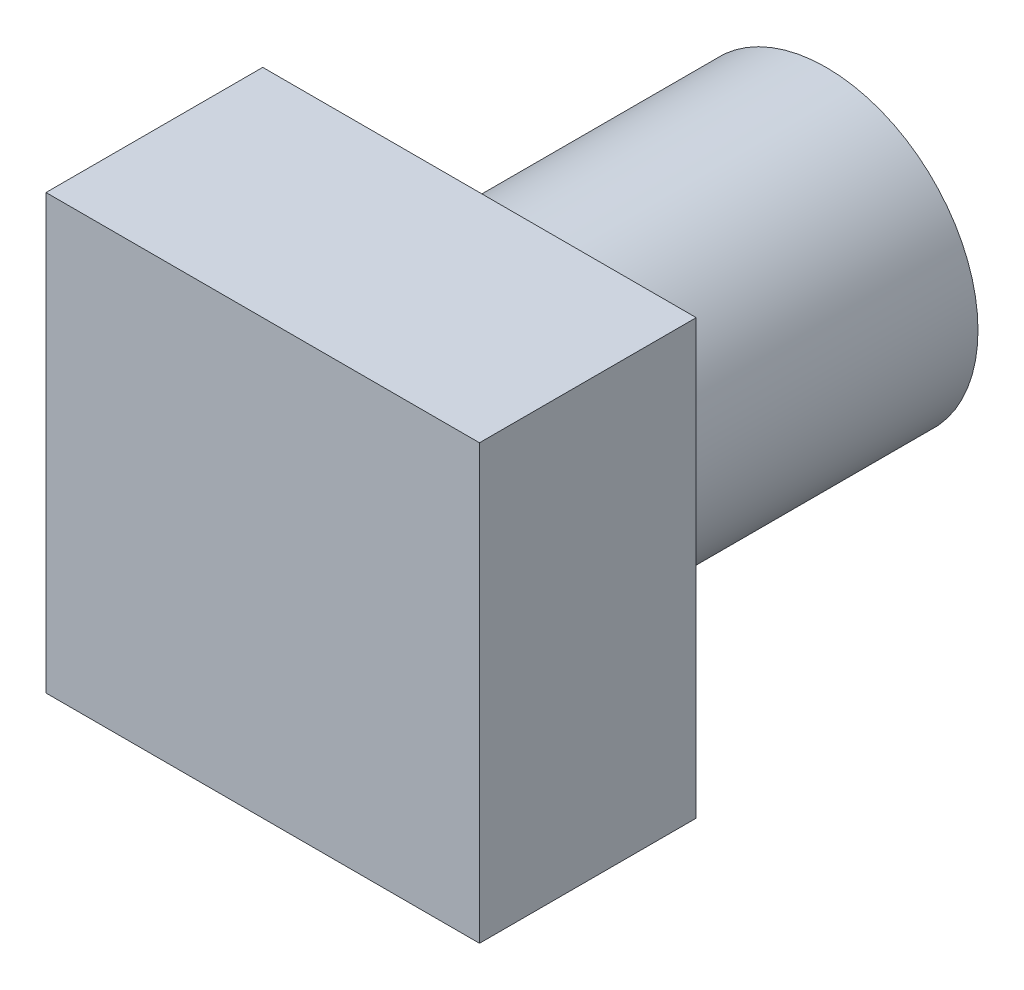
ISO-10303-21;
HEADER;
FILE_DESCRIPTION(('STEP AP214'),'2;1');
FILE_NAME('part.step','',(''),(''),'','','');
FILE_SCHEMA(('AUTOMOTIVE_DESIGN { 1 0 10303 214 1 1 1 1 }'));
ENDSEC;
DATA;
#1=APPLICATION_CONTEXT('core data for automotive mechanical design processes');
#2=APPLICATION_PROTOCOL_DEFINITION('international standard','automotive_design',2000,#1);
#3=PRODUCT_CONTEXT('',#1,'mechanical');
#4=PRODUCT('Part','Part','',(#3));
#5=PRODUCT_RELATED_PRODUCT_CATEGORY('part','',(#4));
#6=PRODUCT_DEFINITION_FORMATION('','',#4);
#7=PRODUCT_DEFINITION_CONTEXT('part definition',#1,'design');
#8=PRODUCT_DEFINITION('design','',#6,#7);
#9=PRODUCT_DEFINITION_SHAPE('','',#8);
#10=(LENGTH_UNIT() NAMED_UNIT(*) SI_UNIT(.MILLI.,.METRE.));
#11=(NAMED_UNIT(*) PLANE_ANGLE_UNIT() SI_UNIT($,.RADIAN.));
#12=(NAMED_UNIT(*) SI_UNIT($,.STERADIAN.) SOLID_ANGLE_UNIT());
#13=UNCERTAINTY_MEASURE_WITH_UNIT(LENGTH_MEASURE(1.E-05),#10,'distance_accuracy_value','');
#14=(GEOMETRIC_REPRESENTATION_CONTEXT(3) GLOBAL_UNCERTAINTY_ASSIGNED_CONTEXT((#13)) GLOBAL_UNIT_ASSIGNED_CONTEXT((#10,
#11,#12)) REPRESENTATION_CONTEXT('',''));
#15=CARTESIAN_POINT('',(0.,0.,0.));
#16=DIRECTION('',(0.,0.,1.));
#17=DIRECTION('',(1.,0.,0.));
#18=AXIS2_PLACEMENT_3D('',#15,#16,#17);
#19=CARTESIAN_POINT('',(0.,0.,5.));
#20=DIRECTION('',(1.,0.,0.));
#21=DIRECTION('',(0.,0.,-1.));
#22=AXIS2_PLACEMENT_3D('',#19,#20,#21);
#23=PLANE('',#22);
#24=DIRECTION('',(0.,1.,0.));
#25=VECTOR('',#24,1.);
#26=CARTESIAN_POINT('',(0.,18.97,5.));
#27=LINE('',#26,#25);
#28=CARTESIAN_POINT('',(0.,0.,5.));
#29=VERTEX_POINT('',#28);
#30=CARTESIAN_POINT('',(0.,10.,5.));
#31=VERTEX_POINT('',#30);
#32=EDGE_CURVE('E113',#29,#31,#27,.T.);
#33=ORIENTED_EDGE('',*,*,#32,.T.);
#34=DIRECTION('',(0.,0.,-1.));
#35=VECTOR('',#34,1.);
#36=CARTESIAN_POINT('',(0.,10.,5.));
#37=LINE('',#36,#35);
#38=CARTESIAN_POINT('',(0.,10.,0.));
#39=VERTEX_POINT('',#38);
#40=EDGE_CURVE('E91',#31,#39,#37,.T.);
#41=ORIENTED_EDGE('',*,*,#40,.T.);
#42=DIRECTION('',(0.,-1.,0.));
#43=VECTOR('',#42,1.);
#44=CARTESIAN_POINT('',(0.,0.,0.));
#45=LINE('',#44,#43);
#46=CARTESIAN_POINT('',(0.,0.,0.));
#47=VERTEX_POINT('',#46);
#48=EDGE_CURVE('E96',#39,#47,#45,.T.);
#49=ORIENTED_EDGE('',*,*,#48,.T.);
#50=DIRECTION('',(0.,0.,-1.));
#51=VECTOR('',#50,1.);
#52=CARTESIAN_POINT('',(0.,0.,5.));
#53=LINE('',#52,#51);
#54=EDGE_CURVE('E44',#29,#47,#53,.T.);
#55=ORIENTED_EDGE('',*,*,#54,.F.);
#56=EDGE_LOOP('',(#33,#41,#49,#55));
#57=FACE_BOUND('',#56,.T.);
#58=ADVANCED_FACE('F41',(#57),#23,.F.);
#59=CARTESIAN_POINT('',(0.,0.,5.));
#60=DIRECTION('',(0.,1.,0.));
#61=DIRECTION('',(0.,0.,1.));
#62=AXIS2_PLACEMENT_3D('',#59,#60,#61);
#63=PLANE('',#62);
#64=DIRECTION('',(1.,0.,0.));
#65=VECTOR('',#64,1.);
#66=CARTESIAN_POINT('',(0.,0.,0.));
#67=LINE('',#66,#65);
#68=CARTESIAN_POINT('',(10.,0.,0.));
#69=VERTEX_POINT('',#68);
#70=EDGE_CURVE('E84',#47,#69,#67,.T.);
#71=ORIENTED_EDGE('',*,*,#70,.T.);
#72=DIRECTION('',(0.,0.,-1.));
#73=VECTOR('',#72,1.);
#74=CARTESIAN_POINT('',(10.,0.,5.));
#75=LINE('',#74,#73);
#76=CARTESIAN_POINT('',(10.,0.,5.));
#77=VERTEX_POINT('',#76);
#78=EDGE_CURVE('E80',#77,#69,#75,.T.);
#79=ORIENTED_EDGE('',*,*,#78,.F.);
#80=DIRECTION('',(1.,0.,0.));
#81=VECTOR('',#80,1.);
#82=CARTESIAN_POINT('',(0.,0.,5.));
#83=LINE('',#82,#81);
#84=EDGE_CURVE('E97',#29,#77,#83,.T.);
#85=ORIENTED_EDGE('',*,*,#84,.F.);
#86=ORIENTED_EDGE('',*,*,#54,.T.);
#87=EDGE_LOOP('',(#71,#79,#85,#86));
#88=FACE_BOUND('',#87,.T.);
#89=ADVANCED_FACE('F106',(#88),#63,.F.);
#90=CARTESIAN_POINT('',(10.,0.,5.));
#91=DIRECTION('',(-1.,0.,0.));
#92=DIRECTION('',(0.,0.,1.));
#93=AXIS2_PLACEMENT_3D('',#90,#91,#92);
#94=PLANE('',#93);
#95=DIRECTION('',(0.,1.,0.));
#96=VECTOR('',#95,1.);
#97=CARTESIAN_POINT('',(10.,0.,0.));
#98=LINE('',#97,#96);
#99=CARTESIAN_POINT('',(10.,10.,0.));
#100=VERTEX_POINT('',#99);
#101=EDGE_CURVE('E74',#69,#100,#98,.T.);
#102=ORIENTED_EDGE('',*,*,#101,.T.);
#103=DIRECTION('',(0.,0.,-1.));
#104=VECTOR('',#103,1.);
#105=CARTESIAN_POINT('',(10.,10.,5.));
#106=LINE('',#105,#104);
#107=CARTESIAN_POINT('',(10.,10.,5.));
#108=VERTEX_POINT('',#107);
#109=EDGE_CURVE('E77',#108,#100,#106,.T.);
#110=ORIENTED_EDGE('',*,*,#109,.F.);
#111=DIRECTION('',(0.,1.,0.));
#112=VECTOR('',#111,1.);
#113=CARTESIAN_POINT('',(10.,0.,5.));
#114=LINE('',#113,#112);
#115=EDGE_CURVE('E57',#77,#108,#114,.T.);
#116=ORIENTED_EDGE('',*,*,#115,.F.);
#117=ORIENTED_EDGE('',*,*,#78,.T.);
#118=EDGE_LOOP('',(#102,#110,#116,#117));
#119=FACE_BOUND('',#118,.T.);
#120=ADVANCED_FACE('F76',(#119),#94,.F.);
#121=CARTESIAN_POINT('',(0.,10.,5.));
#122=DIRECTION('',(0.,-1.,0.));
#123=DIRECTION('',(0.,0.,-1.));
#124=AXIS2_PLACEMENT_3D('',#121,#122,#123);
#125=PLANE('',#124);
#126=DIRECTION('',(-1.,0.,0.));
#127=VECTOR('',#126,1.);
#128=CARTESIAN_POINT('',(0.,10.,0.));
#129=LINE('',#128,#127);
#130=EDGE_CURVE('E83',#100,#39,#129,.T.);
#131=ORIENTED_EDGE('',*,*,#130,.T.);
#132=ORIENTED_EDGE('',*,*,#40,.F.);
#133=DIRECTION('',(-1.,0.,0.));
#134=VECTOR('',#133,1.);
#135=CARTESIAN_POINT('',(0.,10.,5.));
#136=LINE('',#135,#134);
#137=EDGE_CURVE('E90',#108,#31,#136,.T.);
#138=ORIENTED_EDGE('',*,*,#137,.F.);
#139=ORIENTED_EDGE('',*,*,#109,.T.);
#140=EDGE_LOOP('',(#131,#132,#138,#139));
#141=FACE_BOUND('',#140,.T.);
#142=ADVANCED_FACE('F87',(#141),#125,.F.);
#143=CARTESIAN_POINT('',(0.,0.,0.));
#144=DIRECTION('',(0.,0.,-1.));
#145=DIRECTION('',(-1.,0.,0.));
#146=AXIS2_PLACEMENT_3D('',#143,#144,#145);
#147=PLANE('',#146);
#148=CARTESIAN_POINT('',(5.,5.,0.));
#149=DIRECTION('',(0.,0.,-1.));
#150=DIRECTION('',(-1.,0.,0.));
#151=AXIS2_PLACEMENT_3D('',#148,#149,#150);
#152=CIRCLE('',#151,3.5);
#153=CARTESIAN_POINT('',(1.5,5.,0.));
#154=VERTEX_POINT('',#153);
#155=EDGE_CURVE('E11',#154,#154,#152,.T.);
#156=ORIENTED_EDGE('',*,*,#155,.F.);
#157=EDGE_LOOP('',(#156));
#158=FACE_BOUND('',#157,.T.);
#159=ORIENTED_EDGE('',*,*,#48,.F.);
#160=ORIENTED_EDGE('',*,*,#130,.F.);
#161=ORIENTED_EDGE('',*,*,#101,.F.);
#162=ORIENTED_EDGE('',*,*,#70,.F.);
#163=EDGE_LOOP('',(#159,#160,#161,#162));
#164=FACE_BOUND('',#163,.T.);
#165=ADVANCED_FACE('F94',(#158,#164),#147,.T.);
#166=CARTESIAN_POINT('',(5.,5.,-8.));
#167=DIRECTION('',(0.,0.,1.));
#168=DIRECTION('',(1.,0.,0.));
#169=AXIS2_PLACEMENT_3D('',#166,#167,#168);
#170=CYLINDRICAL_SURFACE('',#169,3.5);
#171=CARTESIAN_POINT('',(5.,5.,-8.));
#172=DIRECTION('',(0.,0.,-1.));
#173=DIRECTION('',(-1.,0.,0.));
#174=AXIS2_PLACEMENT_3D('',#171,#172,#173);
#175=CIRCLE('',#174,3.5);
#176=CARTESIAN_POINT('',(1.5,5.,-8.));
#177=VERTEX_POINT('',#176);
#178=EDGE_CURVE('E110',#177,#177,#175,.T.);
#179=ORIENTED_EDGE('',*,*,#178,.F.);
#180=EDGE_LOOP('',(#179));
#181=FACE_BOUND('',#180,.T.);
#182=ORIENTED_EDGE('',*,*,#155,.T.);
#183=EDGE_LOOP('',(#182));
#184=FACE_BOUND('',#183,.T.);
#185=ADVANCED_FACE('F129',(#181,#184),#170,.T.);
#186=CARTESIAN_POINT('',(5.,5.,-8.));
#187=DIRECTION('',(0.,0.,-1.));
#188=DIRECTION('',(-1.,0.,0.));
#189=AXIS2_PLACEMENT_3D('',#186,#187,#188);
#190=PLANE('',#189);
#191=ORIENTED_EDGE('',*,*,#178,.T.);
#192=EDGE_LOOP('',(#191));
#193=FACE_BOUND('',#192,.T.);
#194=ADVANCED_FACE('F123',(#193),#190,.T.);
#195=CARTESIAN_POINT('',(0.,0.,5.));
#196=DIRECTION('',(0.,0.,1.));
#197=DIRECTION('',(1.,0.,0.));
#198=AXIS2_PLACEMENT_3D('',#195,#196,#197);
#199=PLANE('',#198);
#200=ORIENTED_EDGE('',*,*,#84,.T.);
#201=ORIENTED_EDGE('',*,*,#115,.T.);
#202=ORIENTED_EDGE('',*,*,#137,.T.);
#203=ORIENTED_EDGE('',*,*,#32,.F.);
#204=EDGE_LOOP('',(#200,#201,#202,#203));
#205=FACE_BOUND('',#204,.T.);
#206=ADVANCED_FACE('F120',(#205),#199,.T.);
#207=CLOSED_SHELL('',(#58,#89,#120,#142,#165,#185,#194,#206));
#208=MANIFOLD_SOLID_BREP('B2',#207);
#209=ADVANCED_BREP_SHAPE_REPRESENTATION('',(#18,#208),#14);
#210=SHAPE_DEFINITION_REPRESENTATION(#9,#209);
ENDSEC;
END-ISO-10303-21;
